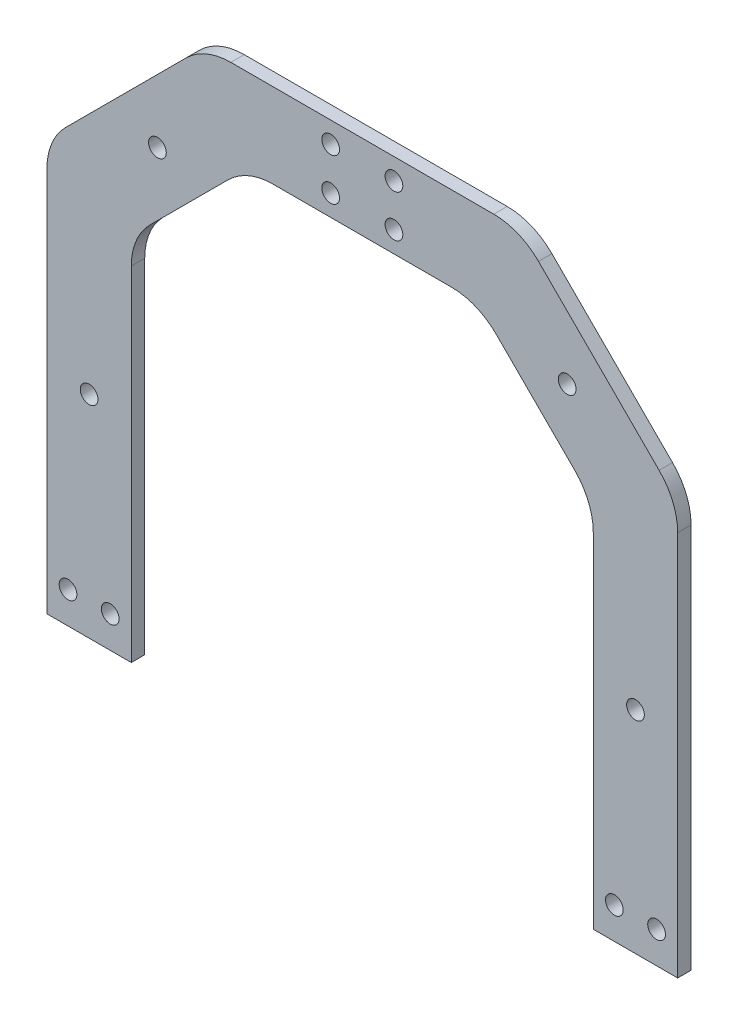
ISO-10303-21;
HEADER;
FILE_DESCRIPTION(('STEP AP214'),'2;1');
FILE_NAME('part.step','',(''),(''),'','','');
FILE_SCHEMA(('AUTOMOTIVE_DESIGN { 1 0 10303 214 1 1 1 1 }'));
ENDSEC;
DATA;
#1=APPLICATION_CONTEXT('core data for automotive mechanical design processes');
#2=APPLICATION_PROTOCOL_DEFINITION('international standard','automotive_design',2000,#1);
#3=PRODUCT_CONTEXT('',#1,'mechanical');
#4=PRODUCT('Part','Part','',(#3));
#5=PRODUCT_RELATED_PRODUCT_CATEGORY('part','',(#4));
#6=PRODUCT_DEFINITION_FORMATION('','',#4);
#7=PRODUCT_DEFINITION_CONTEXT('part definition',#1,'design');
#8=PRODUCT_DEFINITION('design','',#6,#7);
#9=PRODUCT_DEFINITION_SHAPE('','',#8);
#10=(LENGTH_UNIT() NAMED_UNIT(*) SI_UNIT(.MILLI.,.METRE.));
#11=(NAMED_UNIT(*) PLANE_ANGLE_UNIT() SI_UNIT($,.RADIAN.));
#12=(NAMED_UNIT(*) SI_UNIT($,.STERADIAN.) SOLID_ANGLE_UNIT());
#13=UNCERTAINTY_MEASURE_WITH_UNIT(LENGTH_MEASURE(1.E-05),#10,'distance_accuracy_value','');
#14=(GEOMETRIC_REPRESENTATION_CONTEXT(3) GLOBAL_UNCERTAINTY_ASSIGNED_CONTEXT((#13)) GLOBAL_UNIT_ASSIGNED_CONTEXT((#10,
#11,#12)) REPRESENTATION_CONTEXT('',''));
#15=CARTESIAN_POINT('',(0.,0.,0.));
#16=DIRECTION('',(0.,0.,1.));
#17=DIRECTION('',(1.,0.,0.));
#18=AXIS2_PLACEMENT_3D('',#15,#16,#17);
#19=CARTESIAN_POINT('',(109.5,0.,6.35));
#20=DIRECTION('',(0.,1.,0.));
#21=DIRECTION('',(-1.,0.,0.));
#22=AXIS2_PLACEMENT_3D('',#19,#20,#21);
#23=PLANE('',#22);
#24=DIRECTION('',(1.,0.,0.));
#25=VECTOR('',#24,1.);
#26=CARTESIAN_POINT('',(109.5,0.,0.));
#27=LINE('',#26,#25);
#28=CARTESIAN_POINT('',(109.5,0.,0.));
#29=VERTEX_POINT('',#28);
#30=CARTESIAN_POINT('',(149.5,0.,0.));
#31=VERTEX_POINT('',#30);
#32=EDGE_CURVE('E201',#29,#31,#27,.T.);
#33=ORIENTED_EDGE('',*,*,#32,.T.);
#34=DIRECTION('',(0.,0.,-1.));
#35=VECTOR('',#34,1.);
#36=CARTESIAN_POINT('',(149.5,0.,6.35));
#37=LINE('',#36,#35);
#38=CARTESIAN_POINT('',(149.5,0.,6.35));
#39=VERTEX_POINT('',#38);
#40=EDGE_CURVE('E11',#39,#31,#37,.T.);
#41=ORIENTED_EDGE('',*,*,#40,.F.);
#42=DIRECTION('',(1.,0.,0.));
#43=VECTOR('',#42,1.);
#44=CARTESIAN_POINT('',(109.5,0.,6.35));
#45=LINE('',#44,#43);
#46=CARTESIAN_POINT('',(109.5,0.,6.35));
#47=VERTEX_POINT('',#46);
#48=EDGE_CURVE('E240',#47,#39,#45,.T.);
#49=ORIENTED_EDGE('',*,*,#48,.F.);
#50=DIRECTION('',(0.,0.,-1.));
#51=VECTOR('',#50,1.);
#52=CARTESIAN_POINT('',(109.5,0.,6.35));
#53=LINE('',#52,#51);
#54=EDGE_CURVE('E197',#47,#29,#53,.T.);
#55=ORIENTED_EDGE('',*,*,#54,.T.);
#56=EDGE_LOOP('',(#33,#41,#49,#55));
#57=FACE_BOUND('',#56,.T.);
#58=ADVANCED_FACE('F33',(#57),#23,.F.);
#59=CARTESIAN_POINT('',(149.5,182.823593128805,6.35));
#60=DIRECTION('',(-1.,0.,0.));
#61=DIRECTION('',(0.,0.,1.));
#62=AXIS2_PLACEMENT_3D('',#59,#60,#61);
#63=PLANE('',#62);
#64=DIRECTION('',(0.,1.,0.));
#65=VECTOR('',#64,1.);
#66=CARTESIAN_POINT('',(149.5,182.823593128805,0.));
#67=LINE('',#66,#65);
#68=CARTESIAN_POINT('',(149.5,182.823593128805,0.));
#69=VERTEX_POINT('',#68);
#70=EDGE_CURVE('E204',#31,#69,#67,.T.);
#71=ORIENTED_EDGE('',*,*,#70,.T.);
#72=DIRECTION('',(0.,0.,-1.));
#73=VECTOR('',#72,1.);
#74=CARTESIAN_POINT('',(149.5,182.823593128805,6.35));
#75=LINE('',#74,#73);
#76=CARTESIAN_POINT('',(149.5,182.823593128805,6.35));
#77=VERTEX_POINT('',#76);
#78=EDGE_CURVE('E41',#77,#69,#75,.T.);
#79=ORIENTED_EDGE('',*,*,#78,.F.);
#80=DIRECTION('',(0.,1.,0.));
#81=VECTOR('',#80,1.);
#82=CARTESIAN_POINT('',(149.5,182.823593128805,6.35));
#83=LINE('',#82,#81);
#84=EDGE_CURVE('E128',#39,#77,#83,.T.);
#85=ORIENTED_EDGE('',*,*,#84,.F.);
#86=ORIENTED_EDGE('',*,*,#40,.T.);
#87=EDGE_LOOP('',(#71,#79,#85,#86));
#88=FACE_BOUND('',#87,.T.);
#89=ADVANCED_FACE('F359',(#88),#63,.F.);
#90=CARTESIAN_POINT('',(119.499999999992,182.823593128805,6.35));
#91=DIRECTION('',(0.,0.,-1.));
#92=DIRECTION('',(-1.,0.,0.));
#93=AXIS2_PLACEMENT_3D('',#90,#91,#92);
#94=CYLINDRICAL_SURFACE('',#93,30.0000000000081);
#95=CARTESIAN_POINT('',(119.499999999992,182.823593128805,0.));
#96=DIRECTION('',(0.,0.,1.));
#97=DIRECTION('',(1.,0.,0.));
#98=AXIS2_PLACEMENT_3D('',#95,#96,#97);
#99=CIRCLE('',#98,30.0000000000081);
#100=CARTESIAN_POINT('',(140.713203435594,204.036796564407,0.));
#101=VERTEX_POINT('',#100);
#102=EDGE_CURVE('E207',#69,#101,#99,.T.);
#103=ORIENTED_EDGE('',*,*,#102,.T.);
#104=DIRECTION('',(0.,0.,-1.));
#105=VECTOR('',#104,1.);
#106=CARTESIAN_POINT('',(140.713203435594,204.036796564407,6.35));
#107=LINE('',#106,#105);
#108=CARTESIAN_POINT('',(140.713203435594,204.036796564407,6.35));
#109=VERTEX_POINT('',#108);
#110=EDGE_CURVE('E283',#109,#101,#107,.T.);
#111=ORIENTED_EDGE('',*,*,#110,.F.);
#112=CARTESIAN_POINT('',(119.499999999992,182.823593128805,6.35));
#113=DIRECTION('',(0.,0.,1.));
#114=DIRECTION('',(1.,0.,0.));
#115=AXIS2_PLACEMENT_3D('',#112,#113,#114);
#116=CIRCLE('',#115,30.0000000000081);
#117=EDGE_CURVE('E291',#77,#109,#116,.T.);
#118=ORIENTED_EDGE('',*,*,#117,.F.);
#119=ORIENTED_EDGE('',*,*,#78,.T.);
#120=EDGE_LOOP('',(#103,#111,#118,#119));
#121=FACE_BOUND('',#120,.T.);
#122=ADVANCED_FACE('F289',(#121),#94,.T.);
#123=CARTESIAN_POINT('',(83.536796564406,261.213203435594,6.35));
#124=DIRECTION('',(-0.707106781186544,-0.707106781186551,0.));
#125=DIRECTION('',(0.707106781186551,-0.707106781186544,0.));
#126=AXIS2_PLACEMENT_3D('',#123,#124,#125);
#127=PLANE('',#126);
#128=DIRECTION('',(-0.707106781186551,0.707106781186544,0.));
#129=VECTOR('',#128,1.);
#130=CARTESIAN_POINT('',(83.536796564406,261.213203435594,0.));
#131=LINE('',#130,#129);
#132=CARTESIAN_POINT('',(83.536796564406,261.213203435594,0.));
#133=VERTEX_POINT('',#132);
#134=EDGE_CURVE('E209',#101,#133,#131,.T.);
#135=ORIENTED_EDGE('',*,*,#134,.T.);
#136=DIRECTION('',(0.,0.,-1.));
#137=VECTOR('',#136,1.);
#138=CARTESIAN_POINT('',(83.536796564406,261.213203435594,6.35));
#139=LINE('',#138,#137);
#140=CARTESIAN_POINT('',(83.536796564406,261.213203435594,6.35));
#141=VERTEX_POINT('',#140);
#142=EDGE_CURVE('E280',#141,#133,#139,.T.);
#143=ORIENTED_EDGE('',*,*,#142,.F.);
#144=DIRECTION('',(-0.707106781186551,0.707106781186544,0.));
#145=VECTOR('',#144,1.);
#146=CARTESIAN_POINT('',(83.536796564406,261.213203435594,6.35));
#147=LINE('',#146,#145);
#148=EDGE_CURVE('E309',#109,#141,#147,.T.);
#149=ORIENTED_EDGE('',*,*,#148,.F.);
#150=ORIENTED_EDGE('',*,*,#110,.T.);
#151=EDGE_LOOP('',(#135,#143,#149,#150));
#152=FACE_BOUND('',#151,.T.);
#153=ADVANCED_FACE('F300',(#152),#127,.F.);
#154=CARTESIAN_POINT('',(62.323593128804,239.999999999992,6.35));
#155=DIRECTION('',(0.,0.,-1.));
#156=DIRECTION('',(-1.,0.,0.));
#157=AXIS2_PLACEMENT_3D('',#154,#155,#156);
#158=CYLINDRICAL_SURFACE('',#157,30.0000000000081);
#159=CARTESIAN_POINT('',(62.323593128804,239.999999999992,0.));
#160=DIRECTION('',(0.,0.,1.));
#161=DIRECTION('',(1.,0.,0.));
#162=AXIS2_PLACEMENT_3D('',#159,#160,#161);
#163=CIRCLE('',#162,30.0000000000081);
#164=CARTESIAN_POINT('',(62.323593128804,270.,0.));
#165=VERTEX_POINT('',#164);
#166=EDGE_CURVE('E211',#133,#165,#163,.T.);
#167=ORIENTED_EDGE('',*,*,#166,.T.);
#168=DIRECTION('',(0.,0.,-1.));
#169=VECTOR('',#168,1.);
#170=CARTESIAN_POINT('',(62.323593128804,270.,6.35));
#171=LINE('',#170,#169);
#172=CARTESIAN_POINT('',(62.323593128804,270.,6.35));
#173=VERTEX_POINT('',#172);
#174=EDGE_CURVE('E277',#173,#165,#171,.T.);
#175=ORIENTED_EDGE('',*,*,#174,.F.);
#176=CARTESIAN_POINT('',(62.323593128804,239.999999999992,6.35));
#177=DIRECTION('',(0.,0.,1.));
#178=DIRECTION('',(1.,0.,0.));
#179=AXIS2_PLACEMENT_3D('',#176,#177,#178);
#180=CIRCLE('',#179,30.0000000000081);
#181=EDGE_CURVE('E306',#141,#173,#180,.T.);
#182=ORIENTED_EDGE('',*,*,#181,.F.);
#183=ORIENTED_EDGE('',*,*,#142,.T.);
#184=EDGE_LOOP('',(#167,#175,#182,#183));
#185=FACE_BOUND('',#184,.T.);
#186=ADVANCED_FACE('F304',(#185),#158,.T.);
#187=CARTESIAN_POINT('',(62.323593128804,270.,6.35));
#188=DIRECTION('',(0.,-1.,0.));
#189=DIRECTION('',(0.,0.,-1.));
#190=AXIS2_PLACEMENT_3D('',#187,#188,#189);
#191=PLANE('',#190);
#192=DIRECTION('',(-1.,0.,0.));
#193=VECTOR('',#192,1.);
#194=CARTESIAN_POINT('',(62.323593128804,270.,0.));
#195=LINE('',#194,#193);
#196=CARTESIAN_POINT('',(-62.323593128804,270.,0.));
#197=VERTEX_POINT('',#196);
#198=EDGE_CURVE('E213',#165,#197,#195,.T.);
#199=ORIENTED_EDGE('',*,*,#198,.T.);
#200=DIRECTION('',(0.,0.,-1.));
#201=VECTOR('',#200,1.);
#202=CARTESIAN_POINT('',(-62.323593128804,270.,6.35));
#203=LINE('',#202,#201);
#204=CARTESIAN_POINT('',(-62.323593128804,270.,6.35));
#205=VERTEX_POINT('',#204);
#206=EDGE_CURVE('E274',#205,#197,#203,.T.);
#207=ORIENTED_EDGE('',*,*,#206,.F.);
#208=DIRECTION('',(-1.,0.,0.));
#209=VECTOR('',#208,1.);
#210=CARTESIAN_POINT('',(62.323593128804,270.,6.35));
#211=LINE('',#210,#209);
#212=EDGE_CURVE('E308',#173,#205,#211,.T.);
#213=ORIENTED_EDGE('',*,*,#212,.F.);
#214=ORIENTED_EDGE('',*,*,#174,.T.);
#215=EDGE_LOOP('',(#199,#207,#213,#214));
#216=FACE_BOUND('',#215,.T.);
#217=ADVANCED_FACE('F372',(#216),#191,.F.);
#218=CARTESIAN_POINT('',(-62.323593128804,239.999999999992,6.35));
#219=DIRECTION('',(0.,0.,-1.));
#220=DIRECTION('',(-1.,0.,0.));
#221=AXIS2_PLACEMENT_3D('',#218,#219,#220);
#222=CYLINDRICAL_SURFACE('',#221,30.0000000000081);
#223=CARTESIAN_POINT('',(-62.323593128804,239.999999999992,0.));
#224=DIRECTION('',(0.,0.,1.));
#225=DIRECTION('',(-1.,0.,0.));
#226=AXIS2_PLACEMENT_3D('',#223,#224,#225);
#227=CIRCLE('',#226,30.0000000000081);
#228=CARTESIAN_POINT('',(-83.536796564406,261.213203435594,0.));
#229=VERTEX_POINT('',#228);
#230=EDGE_CURVE('E215',#197,#229,#227,.T.);
#231=ORIENTED_EDGE('',*,*,#230,.T.);
#232=DIRECTION('',(0.,0.,-1.));
#233=VECTOR('',#232,1.);
#234=CARTESIAN_POINT('',(-83.536796564406,261.213203435594,6.35));
#235=LINE('',#234,#233);
#236=CARTESIAN_POINT('',(-83.536796564406,261.213203435594,6.35));
#237=VERTEX_POINT('',#236);
#238=EDGE_CURVE('E271',#237,#229,#235,.T.);
#239=ORIENTED_EDGE('',*,*,#238,.F.);
#240=CARTESIAN_POINT('',(-62.323593128804,239.999999999992,6.35));
#241=DIRECTION('',(0.,0.,1.));
#242=DIRECTION('',(-1.,0.,0.));
#243=AXIS2_PLACEMENT_3D('',#240,#241,#242);
#244=CIRCLE('',#243,30.0000000000081);
#245=EDGE_CURVE('E311',#205,#237,#244,.T.);
#246=ORIENTED_EDGE('',*,*,#245,.F.);
#247=ORIENTED_EDGE('',*,*,#206,.T.);
#248=EDGE_LOOP('',(#231,#239,#246,#247));
#249=FACE_BOUND('',#248,.T.);
#250=ADVANCED_FACE('F375',(#249),#222,.T.);
#251=CARTESIAN_POINT('',(-83.536796564406,261.213203435594,6.35));
#252=DIRECTION('',(0.707106781186544,-0.707106781186551,0.));
#253=DIRECTION('',(0.707106781186551,0.707106781186544,0.));
#254=AXIS2_PLACEMENT_3D('',#251,#252,#253);
#255=PLANE('',#254);
#256=DIRECTION('',(-0.707106781186551,-0.707106781186544,0.));
#257=VECTOR('',#256,1.);
#258=CARTESIAN_POINT('',(-83.536796564406,261.213203435594,0.));
#259=LINE('',#258,#257);
#260=CARTESIAN_POINT('',(-140.713203435594,204.036796564407,0.));
#261=VERTEX_POINT('',#260);
#262=EDGE_CURVE('E217',#229,#261,#259,.T.);
#263=ORIENTED_EDGE('',*,*,#262,.T.);
#264=DIRECTION('',(0.,0.,-1.));
#265=VECTOR('',#264,1.);
#266=CARTESIAN_POINT('',(-140.713203435594,204.036796564407,6.35));
#267=LINE('',#266,#265);
#268=CARTESIAN_POINT('',(-140.713203435594,204.036796564407,6.35));
#269=VERTEX_POINT('',#268);
#270=EDGE_CURVE('E268',#269,#261,#267,.T.);
#271=ORIENTED_EDGE('',*,*,#270,.F.);
#272=DIRECTION('',(-0.707106781186551,-0.707106781186544,0.));
#273=VECTOR('',#272,1.);
#274=CARTESIAN_POINT('',(-83.536796564406,261.213203435594,6.35));
#275=LINE('',#274,#273);
#276=EDGE_CURVE('E317',#237,#269,#275,.T.);
#277=ORIENTED_EDGE('',*,*,#276,.F.);
#278=ORIENTED_EDGE('',*,*,#238,.T.);
#279=EDGE_LOOP('',(#263,#271,#277,#278));
#280=FACE_BOUND('',#279,.T.);
#281=ADVANCED_FACE('F379',(#280),#255,.F.);
#282=CARTESIAN_POINT('',(-119.499999999992,182.823593128805,6.35));
#283=DIRECTION('',(0.,0.,-1.));
#284=DIRECTION('',(-1.,0.,0.));
#285=AXIS2_PLACEMENT_3D('',#282,#283,#284);
#286=CYLINDRICAL_SURFACE('',#285,30.0000000000081);
#287=CARTESIAN_POINT('',(-119.499999999992,182.823593128805,0.));
#288=DIRECTION('',(0.,0.,1.));
#289=DIRECTION('',(1.,0.,0.));
#290=AXIS2_PLACEMENT_3D('',#287,#288,#289);
#291=CIRCLE('',#290,30.0000000000081);
#292=CARTESIAN_POINT('',(-149.5,182.823593128805,0.));
#293=VERTEX_POINT('',#292);
#294=EDGE_CURVE('E219',#261,#293,#291,.T.);
#295=ORIENTED_EDGE('',*,*,#294,.T.);
#296=DIRECTION('',(0.,0.,-1.));
#297=VECTOR('',#296,1.);
#298=CARTESIAN_POINT('',(-149.5,182.823593128805,6.35));
#299=LINE('',#298,#297);
#300=CARTESIAN_POINT('',(-149.5,182.823593128805,6.35));
#301=VERTEX_POINT('',#300);
#302=EDGE_CURVE('E265',#301,#293,#299,.T.);
#303=ORIENTED_EDGE('',*,*,#302,.F.);
#304=CARTESIAN_POINT('',(-119.499999999992,182.823593128805,6.35));
#305=DIRECTION('',(0.,0.,1.));
#306=DIRECTION('',(1.,0.,0.));
#307=AXIS2_PLACEMENT_3D('',#304,#305,#306);
#308=CIRCLE('',#307,30.0000000000081);
#309=EDGE_CURVE('E319',#269,#301,#308,.T.);
#310=ORIENTED_EDGE('',*,*,#309,.F.);
#311=ORIENTED_EDGE('',*,*,#270,.T.);
#312=EDGE_LOOP('',(#295,#303,#310,#311));
#313=FACE_BOUND('',#312,.T.);
#314=ADVANCED_FACE('F383',(#313),#286,.T.);
#315=CARTESIAN_POINT('',(-149.5,182.823593128805,6.35));
#316=DIRECTION('',(1.,0.,0.));
#317=DIRECTION('',(0.,0.,-1.));
#318=AXIS2_PLACEMENT_3D('',#315,#316,#317);
#319=PLANE('',#318);
#320=DIRECTION('',(0.,-1.,0.));
#321=VECTOR('',#320,1.);
#322=CARTESIAN_POINT('',(-149.5,182.823593128805,0.));
#323=LINE('',#322,#321);
#324=CARTESIAN_POINT('',(-149.5,0.,0.));
#325=VERTEX_POINT('',#324);
#326=EDGE_CURVE('E221',#293,#325,#323,.T.);
#327=ORIENTED_EDGE('',*,*,#326,.T.);
#328=DIRECTION('',(0.,0.,-1.));
#329=VECTOR('',#328,1.);
#330=CARTESIAN_POINT('',(-149.5,0.,6.35));
#331=LINE('',#330,#329);
#332=CARTESIAN_POINT('',(-149.5,0.,6.35));
#333=VERTEX_POINT('',#332);
#334=EDGE_CURVE('E262',#333,#325,#331,.T.);
#335=ORIENTED_EDGE('',*,*,#334,.F.);
#336=DIRECTION('',(0.,-1.,0.));
#337=VECTOR('',#336,1.);
#338=CARTESIAN_POINT('',(-149.5,182.823593128805,6.35));
#339=LINE('',#338,#337);
#340=EDGE_CURVE('E321',#301,#333,#339,.T.);
#341=ORIENTED_EDGE('',*,*,#340,.F.);
#342=ORIENTED_EDGE('',*,*,#302,.T.);
#343=EDGE_LOOP('',(#327,#335,#341,#342));
#344=FACE_BOUND('',#343,.T.);
#345=ADVANCED_FACE('F387',(#344),#319,.F.);
#346=CARTESIAN_POINT('',(-109.5,0.,6.35));
#347=DIRECTION('',(0.,1.,0.));
#348=DIRECTION('',(-1.,0.,0.));
#349=AXIS2_PLACEMENT_3D('',#346,#347,#348);
#350=PLANE('',#349);
#351=DIRECTION('',(1.,0.,0.));
#352=VECTOR('',#351,1.);
#353=CARTESIAN_POINT('',(-109.5,0.,0.));
#354=LINE('',#353,#352);
#355=CARTESIAN_POINT('',(-109.5,0.,0.));
#356=VERTEX_POINT('',#355);
#357=EDGE_CURVE('E223',#325,#356,#354,.T.);
#358=ORIENTED_EDGE('',*,*,#357,.T.);
#359=DIRECTION('',(0.,0.,-1.));
#360=VECTOR('',#359,1.);
#361=CARTESIAN_POINT('',(-109.5,0.,6.35));
#362=LINE('',#361,#360);
#363=CARTESIAN_POINT('',(-109.5,0.,6.35));
#364=VERTEX_POINT('',#363);
#365=EDGE_CURVE('E259',#364,#356,#362,.T.);
#366=ORIENTED_EDGE('',*,*,#365,.F.);
#367=DIRECTION('',(1.,0.,0.));
#368=VECTOR('',#367,1.);
#369=CARTESIAN_POINT('',(-109.5,0.,6.35));
#370=LINE('',#369,#368);
#371=EDGE_CURVE('E323',#333,#364,#370,.T.);
#372=ORIENTED_EDGE('',*,*,#371,.F.);
#373=ORIENTED_EDGE('',*,*,#334,.T.);
#374=EDGE_LOOP('',(#358,#366,#372,#373));
#375=FACE_BOUND('',#374,.T.);
#376=ADVANCED_FACE('F391',(#375),#350,.F.);
#377=CARTESIAN_POINT('',(-109.5,162.823593128805,6.35));
#378=DIRECTION('',(-1.,0.,0.));
#379=DIRECTION('',(0.,-1.,0.));
#380=AXIS2_PLACEMENT_3D('',#377,#378,#379);
#381=PLANE('',#380);
#382=DIRECTION('',(0.,1.,0.));
#383=VECTOR('',#382,1.);
#384=CARTESIAN_POINT('',(-109.5,162.823593128805,0.));
#385=LINE('',#384,#383);
#386=CARTESIAN_POINT('',(-109.5,162.823593128805,0.));
#387=VERTEX_POINT('',#386);
#388=EDGE_CURVE('E225',#356,#387,#385,.T.);
#389=ORIENTED_EDGE('',*,*,#388,.T.);
#390=DIRECTION('',(0.,0.,-1.));
#391=VECTOR('',#390,1.);
#392=CARTESIAN_POINT('',(-109.5,162.823593128805,6.35));
#393=LINE('',#392,#391);
#394=CARTESIAN_POINT('',(-109.5,162.823593128805,6.35));
#395=VERTEX_POINT('',#394);
#396=EDGE_CURVE('E256',#395,#387,#393,.T.);
#397=ORIENTED_EDGE('',*,*,#396,.F.);
#398=DIRECTION('',(0.,1.,0.));
#399=VECTOR('',#398,1.);
#400=CARTESIAN_POINT('',(-109.5,162.823593128805,6.35));
#401=LINE('',#400,#399);
#402=EDGE_CURVE('E325',#364,#395,#401,.T.);
#403=ORIENTED_EDGE('',*,*,#402,.F.);
#404=ORIENTED_EDGE('',*,*,#365,.T.);
#405=EDGE_LOOP('',(#389,#397,#403,#404));
#406=FACE_BOUND('',#405,.T.);
#407=ADVANCED_FACE('F395',(#406),#381,.F.);
#408=CARTESIAN_POINT('',(-79.4999999999919,162.823593128805,6.35));
#409=DIRECTION('',(0.,0.,-1.));
#410=DIRECTION('',(-1.,0.,0.));
#411=AXIS2_PLACEMENT_3D('',#408,#409,#410);
#412=CYLINDRICAL_SURFACE('',#411,30.0000000000081);
#413=CARTESIAN_POINT('',(-79.4999999999919,162.823593128805,0.));
#414=DIRECTION('',(0.,0.,-1.));
#415=DIRECTION('',(1.,0.,0.));
#416=AXIS2_PLACEMENT_3D('',#413,#414,#415);
#417=CIRCLE('',#416,30.0000000000081);
#418=CARTESIAN_POINT('',(-100.713203435594,184.036796564407,0.));
#419=VERTEX_POINT('',#418);
#420=EDGE_CURVE('E227',#387,#419,#417,.T.);
#421=ORIENTED_EDGE('',*,*,#420,.T.);
#422=DIRECTION('',(0.,0.,-1.));
#423=VECTOR('',#422,1.);
#424=CARTESIAN_POINT('',(-100.713203435594,184.036796564407,6.35));
#425=LINE('',#424,#423);
#426=CARTESIAN_POINT('',(-100.713203435594,184.036796564407,6.35));
#427=VERTEX_POINT('',#426);
#428=EDGE_CURVE('E253',#427,#419,#425,.T.);
#429=ORIENTED_EDGE('',*,*,#428,.F.);
#430=CARTESIAN_POINT('',(-79.4999999999919,162.823593128805,6.35));
#431=DIRECTION('',(0.,0.,-1.));
#432=DIRECTION('',(1.,0.,0.));
#433=AXIS2_PLACEMENT_3D('',#430,#431,#432);
#434=CIRCLE('',#433,30.0000000000081);
#435=EDGE_CURVE('E327',#395,#427,#434,.T.);
#436=ORIENTED_EDGE('',*,*,#435,.F.);
#437=ORIENTED_EDGE('',*,*,#396,.T.);
#438=EDGE_LOOP('',(#421,#429,#436,#437));
#439=FACE_BOUND('',#438,.T.);
#440=ADVANCED_FACE('F399',(#439),#412,.F.);
#441=CARTESIAN_POINT('',(-63.5367965644059,221.213203435594,6.35));
#442=DIRECTION('',(-0.707106781186539,0.707106781186556,0.));
#443=DIRECTION('',(-0.707106781186556,-0.707106781186539,0.));
#444=AXIS2_PLACEMENT_3D('',#441,#442,#443);
#445=PLANE('',#444);
#446=DIRECTION('',(0.707106781186556,0.707106781186539,0.));
#447=VECTOR('',#446,1.);
#448=CARTESIAN_POINT('',(-63.5367965644059,221.213203435594,0.));
#449=LINE('',#448,#447);
#450=CARTESIAN_POINT('',(-63.5367965644059,221.213203435594,0.));
#451=VERTEX_POINT('',#450);
#452=EDGE_CURVE('E229',#419,#451,#449,.T.);
#453=ORIENTED_EDGE('',*,*,#452,.T.);
#454=DIRECTION('',(0.,0.,-1.));
#455=VECTOR('',#454,1.);
#456=CARTESIAN_POINT('',(-63.5367965644059,221.213203435594,6.35));
#457=LINE('',#456,#455);
#458=CARTESIAN_POINT('',(-63.5367965644059,221.213203435594,6.35));
#459=VERTEX_POINT('',#458);
#460=EDGE_CURVE('E250',#459,#451,#457,.T.);
#461=ORIENTED_EDGE('',*,*,#460,.F.);
#462=DIRECTION('',(0.707106781186556,0.707106781186539,0.));
#463=VECTOR('',#462,1.);
#464=CARTESIAN_POINT('',(-63.5367965644059,221.213203435594,6.35));
#465=LINE('',#464,#463);
#466=EDGE_CURVE('E329',#427,#459,#465,.T.);
#467=ORIENTED_EDGE('',*,*,#466,.F.);
#468=ORIENTED_EDGE('',*,*,#428,.T.);
#469=EDGE_LOOP('',(#453,#461,#467,#468));
#470=FACE_BOUND('',#469,.T.);
#471=ADVANCED_FACE('F403',(#470),#445,.F.);
#472=CARTESIAN_POINT('',(-42.323593128804,199.999999999992,6.35));
#473=DIRECTION('',(0.,0.,-1.));
#474=DIRECTION('',(-1.,0.,0.));
#475=AXIS2_PLACEMENT_3D('',#472,#473,#474);
#476=CYLINDRICAL_SURFACE('',#475,30.0000000000081);
#477=CARTESIAN_POINT('',(-42.323593128804,199.999999999992,0.));
#478=DIRECTION('',(0.,0.,-1.));
#479=DIRECTION('',(-1.,0.,0.));
#480=AXIS2_PLACEMENT_3D('',#477,#478,#479);
#481=CIRCLE('',#480,30.0000000000081);
#482=CARTESIAN_POINT('',(-42.323593128804,230.,0.));
#483=VERTEX_POINT('',#482);
#484=EDGE_CURVE('E231',#451,#483,#481,.T.);
#485=ORIENTED_EDGE('',*,*,#484,.T.);
#486=DIRECTION('',(0.,0.,-1.));
#487=VECTOR('',#486,1.);
#488=CARTESIAN_POINT('',(-42.323593128804,230.,6.35));
#489=LINE('',#488,#487);
#490=CARTESIAN_POINT('',(-42.323593128804,230.,6.35));
#491=VERTEX_POINT('',#490);
#492=EDGE_CURVE('E247',#491,#483,#489,.T.);
#493=ORIENTED_EDGE('',*,*,#492,.F.);
#494=CARTESIAN_POINT('',(-42.323593128804,199.999999999992,6.35));
#495=DIRECTION('',(0.,0.,-1.));
#496=DIRECTION('',(-1.,0.,0.));
#497=AXIS2_PLACEMENT_3D('',#494,#495,#496);
#498=CIRCLE('',#497,30.0000000000081);
#499=EDGE_CURVE('E331',#459,#491,#498,.T.);
#500=ORIENTED_EDGE('',*,*,#499,.F.);
#501=ORIENTED_EDGE('',*,*,#460,.T.);
#502=EDGE_LOOP('',(#485,#493,#500,#501));
#503=FACE_BOUND('',#502,.T.);
#504=ADVANCED_FACE('F407',(#503),#476,.F.);
#505=CARTESIAN_POINT('',(42.323593128804,230.,6.35));
#506=DIRECTION('',(0.,1.,0.));
#507=DIRECTION('',(0.,0.,1.));
#508=AXIS2_PLACEMENT_3D('',#505,#506,#507);
#509=PLANE('',#508);
#510=DIRECTION('',(1.,0.,0.));
#511=VECTOR('',#510,1.);
#512=CARTESIAN_POINT('',(42.323593128804,230.,0.));
#513=LINE('',#512,#511);
#514=CARTESIAN_POINT('',(42.323593128804,230.,0.));
#515=VERTEX_POINT('',#514);
#516=EDGE_CURVE('E233',#483,#515,#513,.T.);
#517=ORIENTED_EDGE('',*,*,#516,.T.);
#518=DIRECTION('',(0.,0.,-1.));
#519=VECTOR('',#518,1.);
#520=CARTESIAN_POINT('',(42.323593128804,230.,6.35));
#521=LINE('',#520,#519);
#522=CARTESIAN_POINT('',(42.323593128804,230.,6.35));
#523=VERTEX_POINT('',#522);
#524=EDGE_CURVE('E244',#523,#515,#521,.T.);
#525=ORIENTED_EDGE('',*,*,#524,.F.);
#526=DIRECTION('',(1.,0.,0.));
#527=VECTOR('',#526,1.);
#528=CARTESIAN_POINT('',(42.323593128804,230.,6.35));
#529=LINE('',#528,#527);
#530=EDGE_CURVE('E333',#491,#523,#529,.T.);
#531=ORIENTED_EDGE('',*,*,#530,.F.);
#532=ORIENTED_EDGE('',*,*,#492,.T.);
#533=EDGE_LOOP('',(#517,#525,#531,#532));
#534=FACE_BOUND('',#533,.T.);
#535=ADVANCED_FACE('F339',(#534),#509,.F.);
#536=CARTESIAN_POINT('',(42.323593128804,199.999999999992,6.35));
#537=DIRECTION('',(0.,0.,-1.));
#538=DIRECTION('',(-1.,0.,0.));
#539=AXIS2_PLACEMENT_3D('',#536,#537,#538);
#540=CYLINDRICAL_SURFACE('',#539,30.0000000000081);
#541=CARTESIAN_POINT('',(42.323593128804,199.999999999992,0.));
#542=DIRECTION('',(0.,0.,-1.));
#543=DIRECTION('',(1.,0.,0.));
#544=AXIS2_PLACEMENT_3D('',#541,#542,#543);
#545=CIRCLE('',#544,30.0000000000081);
#546=CARTESIAN_POINT('',(63.5367965644058,221.213203435594,0.));
#547=VERTEX_POINT('',#546);
#548=EDGE_CURVE('E235',#515,#547,#545,.T.);
#549=ORIENTED_EDGE('',*,*,#548,.T.);
#550=DIRECTION('',(0.,0.,-1.));
#551=VECTOR('',#550,1.);
#552=CARTESIAN_POINT('',(63.5367965644058,221.213203435594,6.35));
#553=LINE('',#552,#551);
#554=CARTESIAN_POINT('',(63.5367965644058,221.213203435594,6.35));
#555=VERTEX_POINT('',#554);
#556=EDGE_CURVE('E192',#555,#547,#553,.T.);
#557=ORIENTED_EDGE('',*,*,#556,.F.);
#558=CARTESIAN_POINT('',(42.323593128804,199.999999999992,6.35));
#559=DIRECTION('',(0.,0.,-1.));
#560=DIRECTION('',(1.,0.,0.));
#561=AXIS2_PLACEMENT_3D('',#558,#559,#560);
#562=CIRCLE('',#561,30.0000000000081);
#563=EDGE_CURVE('E183',#523,#555,#562,.T.);
#564=ORIENTED_EDGE('',*,*,#563,.F.);
#565=ORIENTED_EDGE('',*,*,#524,.T.);
#566=EDGE_LOOP('',(#549,#557,#564,#565));
#567=FACE_BOUND('',#566,.T.);
#568=ADVANCED_FACE('F343',(#567),#540,.F.);
#569=CARTESIAN_POINT('',(63.5367965644059,221.213203435594,6.35));
#570=DIRECTION('',(0.707106781186539,0.707106781186556,0.));
#571=DIRECTION('',(-0.707106781186556,0.707106781186539,0.));
#572=AXIS2_PLACEMENT_3D('',#569,#570,#571);
#573=PLANE('',#572);
#574=DIRECTION('',(0.707106781186556,-0.707106781186539,0.));
#575=VECTOR('',#574,1.);
#576=CARTESIAN_POINT('',(63.5367965644059,221.213203435594,0.));
#577=LINE('',#576,#575);
#578=CARTESIAN_POINT('',(100.713203435594,184.036796564407,0.));
#579=VERTEX_POINT('',#578);
#580=EDGE_CURVE('E191',#547,#579,#577,.T.);
#581=ORIENTED_EDGE('',*,*,#580,.T.);
#582=DIRECTION('',(0.,0.,-1.));
#583=VECTOR('',#582,1.);
#584=CARTESIAN_POINT('',(100.713203435594,184.036796564407,6.35));
#585=LINE('',#584,#583);
#586=CARTESIAN_POINT('',(100.713203435594,184.036796564407,6.35));
#587=VERTEX_POINT('',#586);
#588=EDGE_CURVE('E188',#587,#579,#585,.T.);
#589=ORIENTED_EDGE('',*,*,#588,.F.);
#590=DIRECTION('',(0.707106781186556,-0.707106781186539,0.));
#591=VECTOR('',#590,1.);
#592=CARTESIAN_POINT('',(63.5367965644059,221.213203435594,6.35));
#593=LINE('',#592,#591);
#594=EDGE_CURVE('E177',#555,#587,#593,.T.);
#595=ORIENTED_EDGE('',*,*,#594,.F.);
#596=ORIENTED_EDGE('',*,*,#556,.T.);
#597=EDGE_LOOP('',(#581,#589,#595,#596));
#598=FACE_BOUND('',#597,.T.);
#599=ADVANCED_FACE('F189',(#598),#573,.F.);
#600=CARTESIAN_POINT('',(79.4999999999919,162.823593128805,6.35));
#601=DIRECTION('',(0.,0.,-1.));
#602=DIRECTION('',(-1.,0.,0.));
#603=AXIS2_PLACEMENT_3D('',#600,#601,#602);
#604=CYLINDRICAL_SURFACE('',#603,30.0000000000081);
#605=CARTESIAN_POINT('',(79.4999999999919,162.823593128805,0.));
#606=DIRECTION('',(0.,0.,-1.));
#607=DIRECTION('',(1.,0.,0.));
#608=AXIS2_PLACEMENT_3D('',#605,#606,#607);
#609=CIRCLE('',#608,30.0000000000081);
#610=CARTESIAN_POINT('',(109.5,162.823593128805,0.));
#611=VERTEX_POINT('',#610);
#612=EDGE_CURVE('E114',#579,#611,#609,.T.);
#613=ORIENTED_EDGE('',*,*,#612,.T.);
#614=DIRECTION('',(0.,0.,-1.));
#615=VECTOR('',#614,1.);
#616=CARTESIAN_POINT('',(109.5,162.823593128805,6.35));
#617=LINE('',#616,#615);
#618=CARTESIAN_POINT('',(109.5,162.823593128805,6.35));
#619=VERTEX_POINT('',#618);
#620=EDGE_CURVE('E193',#619,#611,#617,.T.);
#621=ORIENTED_EDGE('',*,*,#620,.F.);
#622=CARTESIAN_POINT('',(79.4999999999919,162.823593128805,6.35));
#623=DIRECTION('',(0.,0.,-1.));
#624=DIRECTION('',(1.,0.,0.));
#625=AXIS2_PLACEMENT_3D('',#622,#623,#624);
#626=CIRCLE('',#625,30.0000000000081);
#627=EDGE_CURVE('E181',#587,#619,#626,.T.);
#628=ORIENTED_EDGE('',*,*,#627,.F.);
#629=ORIENTED_EDGE('',*,*,#588,.T.);
#630=EDGE_LOOP('',(#613,#621,#628,#629));
#631=FACE_BOUND('',#630,.T.);
#632=ADVANCED_FACE('F195',(#631),#604,.F.);
#633=CARTESIAN_POINT('',(109.5,162.823593128805,6.35));
#634=DIRECTION('',(1.,0.,0.));
#635=DIRECTION('',(0.,1.,0.));
#636=AXIS2_PLACEMENT_3D('',#633,#634,#635);
#637=PLANE('',#636);
#638=DIRECTION('',(0.,-1.,0.));
#639=VECTOR('',#638,1.);
#640=CARTESIAN_POINT('',(109.5,162.823593128805,0.));
#641=LINE('',#640,#639);
#642=EDGE_CURVE('E120',#611,#29,#641,.T.);
#643=ORIENTED_EDGE('',*,*,#642,.T.);
#644=ORIENTED_EDGE('',*,*,#54,.F.);
#645=DIRECTION('',(0.,-1.,0.));
#646=VECTOR('',#645,1.);
#647=CARTESIAN_POINT('',(109.5,162.823593128805,6.35));
#648=LINE('',#647,#646);
#649=EDGE_CURVE('E49',#619,#47,#648,.T.);
#650=ORIENTED_EDGE('',*,*,#649,.F.);
#651=ORIENTED_EDGE('',*,*,#620,.T.);
#652=EDGE_LOOP('',(#643,#644,#650,#651));
#653=FACE_BOUND('',#652,.T.);
#654=ADVANCED_FACE('F347',(#653),#637,.F.);
#655=CARTESIAN_POINT('',(119.499999999992,182.823593128805,6.35));
#656=DIRECTION('',(0.,0.,1.));
#657=DIRECTION('',(1.,0.,0.));
#658=AXIS2_PLACEMENT_3D('',#655,#656,#657);
#659=PLANE('',#658);
#660=CARTESIAN_POINT('',(-119.5,15.,6.35));
#661=DIRECTION('',(0.,0.,1.));
#662=DIRECTION('',(1.,0.,0.));
#663=AXIS2_PLACEMENT_3D('',#660,#661,#662);
#664=CIRCLE('',#663,4.2);
#665=CARTESIAN_POINT('',(-115.3,15.,6.35));
#666=VERTEX_POINT('',#665);
#667=EDGE_CURVE('E573',#666,#666,#664,.T.);
#668=ORIENTED_EDGE('',*,*,#667,.F.);
#669=EDGE_LOOP('',(#668));
#670=FACE_BOUND('',#669,.T.);
#671=CARTESIAN_POINT('',(-139.5,15.,6.35));
#672=DIRECTION('',(0.,0.,1.));
#673=DIRECTION('',(1.,0.,0.));
#674=AXIS2_PLACEMENT_3D('',#671,#672,#673);
#675=CIRCLE('',#674,4.20000000000001);
#676=CARTESIAN_POINT('',(-135.3,15.,6.35));
#677=VERTEX_POINT('',#676);
#678=EDGE_CURVE('E575',#677,#677,#675,.T.);
#679=ORIENTED_EDGE('',*,*,#678,.F.);
#680=EDGE_LOOP('',(#679));
#681=FACE_BOUND('',#680,.T.);
#682=CARTESIAN_POINT('',(139.5,15.,6.35));
#683=DIRECTION('',(0.,0.,1.));
#684=DIRECTION('',(1.,0.,0.));
#685=AXIS2_PLACEMENT_3D('',#682,#683,#684);
#686=CIRCLE('',#685,4.20000000000001);
#687=CARTESIAN_POINT('',(143.7,15.,6.35));
#688=VERTEX_POINT('',#687);
#689=EDGE_CURVE('E583',#688,#688,#686,.T.);
#690=ORIENTED_EDGE('',*,*,#689,.F.);
#691=EDGE_LOOP('',(#690));
#692=FACE_BOUND('',#691,.T.);
#693=CARTESIAN_POINT('',(-15.,260.,6.35));
#694=DIRECTION('',(0.,0.,1.));
#695=DIRECTION('',(1.,0.,0.));
#696=AXIS2_PLACEMENT_3D('',#693,#694,#695);
#697=CIRCLE('',#696,4.2);
#698=CARTESIAN_POINT('',(-10.8,260.,6.35));
#699=VERTEX_POINT('',#698);
#700=EDGE_CURVE('E589',#699,#699,#697,.T.);
#701=ORIENTED_EDGE('',*,*,#700,.F.);
#702=EDGE_LOOP('',(#701));
#703=FACE_BOUND('',#702,.T.);
#704=CARTESIAN_POINT('',(-15.,240.,6.35));
#705=DIRECTION('',(0.,0.,1.));
#706=DIRECTION('',(1.,0.,0.));
#707=AXIS2_PLACEMENT_3D('',#704,#705,#706);
#708=CIRCLE('',#707,4.2);
#709=CARTESIAN_POINT('',(-10.8,240.,6.35));
#710=VERTEX_POINT('',#709);
#711=EDGE_CURVE('E595',#710,#710,#708,.T.);
#712=ORIENTED_EDGE('',*,*,#711,.F.);
#713=EDGE_LOOP('',(#712));
#714=FACE_BOUND('',#713,.T.);
#715=CARTESIAN_POINT('',(15.,240.,6.35));
#716=DIRECTION('',(0.,0.,1.));
#717=DIRECTION('',(1.,0.,0.));
#718=AXIS2_PLACEMENT_3D('',#715,#716,#717);
#719=CIRCLE('',#718,4.2);
#720=CARTESIAN_POINT('',(19.2,240.,6.35));
#721=VERTEX_POINT('',#720);
#722=EDGE_CURVE('E601',#721,#721,#719,.T.);
#723=ORIENTED_EDGE('',*,*,#722,.F.);
#724=EDGE_LOOP('',(#723));
#725=FACE_BOUND('',#724,.T.);
#726=CARTESIAN_POINT('',(15.,260.,6.35));
#727=DIRECTION('',(0.,0.,1.));
#728=DIRECTION('',(1.,0.,0.));
#729=AXIS2_PLACEMENT_3D('',#726,#727,#728);
#730=CIRCLE('',#729,4.2);
#731=CARTESIAN_POINT('',(19.2,260.,6.35));
#732=VERTEX_POINT('',#731);
#733=EDGE_CURVE('E607',#732,#732,#730,.T.);
#734=ORIENTED_EDGE('',*,*,#733,.F.);
#735=EDGE_LOOP('',(#734));
#736=FACE_BOUND('',#735,.T.);
#737=CARTESIAN_POINT('',(-129.5,100.125,6.35));
#738=DIRECTION('',(0.,0.,1.));
#739=DIRECTION('',(1.,0.,0.));
#740=AXIS2_PLACEMENT_3D('',#737,#738,#739);
#741=CIRCLE('',#740,4.20000000000001);
#742=CARTESIAN_POINT('',(-125.3,100.125,6.35));
#743=VERTEX_POINT('',#742);
#744=EDGE_CURVE('E613',#743,#743,#741,.T.);
#745=ORIENTED_EDGE('',*,*,#744,.F.);
#746=EDGE_LOOP('',(#745));
#747=FACE_BOUND('',#746,.T.);
#748=CARTESIAN_POINT('',(-97.1250000000003,217.625,6.35));
#749=DIRECTION('',(0.,0.,1.));
#750=DIRECTION('',(1.,0.,0.));
#751=AXIS2_PLACEMENT_3D('',#748,#749,#750);
#752=CIRCLE('',#751,4.2);
#753=CARTESIAN_POINT('',(-92.9250000000003,217.625,6.35));
#754=VERTEX_POINT('',#753);
#755=EDGE_CURVE('E619',#754,#754,#752,.T.);
#756=ORIENTED_EDGE('',*,*,#755,.F.);
#757=EDGE_LOOP('',(#756));
#758=FACE_BOUND('',#757,.T.);
#759=CARTESIAN_POINT('',(129.5,100.125,6.35));
#760=DIRECTION('',(0.,0.,1.));
#761=DIRECTION('',(1.,0.,0.));
#762=AXIS2_PLACEMENT_3D('',#759,#760,#761);
#763=CIRCLE('',#762,4.20000000000001);
#764=CARTESIAN_POINT('',(133.7,100.125,6.35));
#765=VERTEX_POINT('',#764);
#766=EDGE_CURVE('E625',#765,#765,#763,.T.);
#767=ORIENTED_EDGE('',*,*,#766,.F.);
#768=EDGE_LOOP('',(#767));
#769=FACE_BOUND('',#768,.T.);
#770=CARTESIAN_POINT('',(97.1250000000003,217.625,6.35));
#771=DIRECTION('',(0.,0.,1.));
#772=DIRECTION('',(1.,0.,0.));
#773=AXIS2_PLACEMENT_3D('',#770,#771,#772);
#774=CIRCLE('',#773,4.2);
#775=CARTESIAN_POINT('',(101.325,217.625,6.35));
#776=VERTEX_POINT('',#775);
#777=EDGE_CURVE('E631',#776,#776,#774,.T.);
#778=ORIENTED_EDGE('',*,*,#777,.F.);
#779=EDGE_LOOP('',(#778));
#780=FACE_BOUND('',#779,.T.);
#781=CARTESIAN_POINT('',(119.5,15.0000000000001,6.35));
#782=DIRECTION('',(0.,0.,1.));
#783=DIRECTION('',(1.,0.,0.));
#784=AXIS2_PLACEMENT_3D('',#781,#782,#783);
#785=CIRCLE('',#784,4.2);
#786=CARTESIAN_POINT('',(123.7,15.0000000000001,6.35));
#787=VERTEX_POINT('',#786);
#788=EDGE_CURVE('E637',#787,#787,#785,.T.);
#789=ORIENTED_EDGE('',*,*,#788,.F.);
#790=EDGE_LOOP('',(#789));
#791=FACE_BOUND('',#790,.T.);
#792=ORIENTED_EDGE('',*,*,#48,.T.);
#793=ORIENTED_EDGE('',*,*,#84,.T.);
#794=ORIENTED_EDGE('',*,*,#117,.T.);
#795=ORIENTED_EDGE('',*,*,#148,.T.);
#796=ORIENTED_EDGE('',*,*,#181,.T.);
#797=ORIENTED_EDGE('',*,*,#212,.T.);
#798=ORIENTED_EDGE('',*,*,#245,.T.);
#799=ORIENTED_EDGE('',*,*,#276,.T.);
#800=ORIENTED_EDGE('',*,*,#309,.T.);
#801=ORIENTED_EDGE('',*,*,#340,.T.);
#802=ORIENTED_EDGE('',*,*,#371,.T.);
#803=ORIENTED_EDGE('',*,*,#402,.T.);
#804=ORIENTED_EDGE('',*,*,#435,.T.);
#805=ORIENTED_EDGE('',*,*,#466,.T.);
#806=ORIENTED_EDGE('',*,*,#499,.T.);
#807=ORIENTED_EDGE('',*,*,#530,.T.);
#808=ORIENTED_EDGE('',*,*,#563,.T.);
#809=ORIENTED_EDGE('',*,*,#594,.T.);
#810=ORIENTED_EDGE('',*,*,#627,.T.);
#811=ORIENTED_EDGE('',*,*,#649,.T.);
#812=EDGE_LOOP('',(#792,#793,#794,#795,#796,#797,#798,#799,#800,#801,#802,#803,#804,#805,#806,
#807,#808,#809,#810,#811));
#813=FACE_BOUND('',#812,.T.);
#814=ADVANCED_FACE('F179',(#670,#681,#692,#703,#714,#725,#736,#747,#758,#769,#780,#791,#813),
#659,.T.);
#815=CARTESIAN_POINT('',(119.499999999992,182.823593128805,0.));
#816=DIRECTION('',(0.,0.,1.));
#817=DIRECTION('',(1.,0.,0.));
#818=AXIS2_PLACEMENT_3D('',#815,#816,#817);
#819=PLANE('',#818);
#820=CARTESIAN_POINT('',(-119.5,15.,0.));
#821=DIRECTION('',(0.,0.,1.));
#822=DIRECTION('',(1.,0.,0.));
#823=AXIS2_PLACEMENT_3D('',#820,#821,#822);
#824=CIRCLE('',#823,4.2);
#825=CARTESIAN_POINT('',(-115.3,15.,0.));
#826=VERTEX_POINT('',#825);
#827=EDGE_CURVE('E570',#826,#826,#824,.T.);
#828=ORIENTED_EDGE('',*,*,#827,.T.);
#829=EDGE_LOOP('',(#828));
#830=FACE_BOUND('',#829,.T.);
#831=CARTESIAN_POINT('',(-139.5,15.,0.));
#832=DIRECTION('',(0.,0.,1.));
#833=DIRECTION('',(1.,0.,0.));
#834=AXIS2_PLACEMENT_3D('',#831,#832,#833);
#835=CIRCLE('',#834,4.20000000000001);
#836=CARTESIAN_POINT('',(-135.3,15.,0.));
#837=VERTEX_POINT('',#836);
#838=EDGE_CURVE('E580',#837,#837,#835,.T.);
#839=ORIENTED_EDGE('',*,*,#838,.T.);
#840=EDGE_LOOP('',(#839));
#841=FACE_BOUND('',#840,.T.);
#842=CARTESIAN_POINT('',(139.5,15.,0.));
#843=DIRECTION('',(0.,0.,1.));
#844=DIRECTION('',(1.,0.,0.));
#845=AXIS2_PLACEMENT_3D('',#842,#843,#844);
#846=CIRCLE('',#845,4.20000000000001);
#847=CARTESIAN_POINT('',(143.7,15.,0.));
#848=VERTEX_POINT('',#847);
#849=EDGE_CURVE('E586',#848,#848,#846,.T.);
#850=ORIENTED_EDGE('',*,*,#849,.T.);
#851=EDGE_LOOP('',(#850));
#852=FACE_BOUND('',#851,.T.);
#853=CARTESIAN_POINT('',(-15.,260.,0.));
#854=DIRECTION('',(0.,0.,1.));
#855=DIRECTION('',(1.,0.,0.));
#856=AXIS2_PLACEMENT_3D('',#853,#854,#855);
#857=CIRCLE('',#856,4.2);
#858=CARTESIAN_POINT('',(-10.8,260.,0.));
#859=VERTEX_POINT('',#858);
#860=EDGE_CURVE('E592',#859,#859,#857,.T.);
#861=ORIENTED_EDGE('',*,*,#860,.T.);
#862=EDGE_LOOP('',(#861));
#863=FACE_BOUND('',#862,.T.);
#864=CARTESIAN_POINT('',(-15.,240.,0.));
#865=DIRECTION('',(0.,0.,1.));
#866=DIRECTION('',(1.,0.,0.));
#867=AXIS2_PLACEMENT_3D('',#864,#865,#866);
#868=CIRCLE('',#867,4.2);
#869=CARTESIAN_POINT('',(-10.8,240.,0.));
#870=VERTEX_POINT('',#869);
#871=EDGE_CURVE('E598',#870,#870,#868,.T.);
#872=ORIENTED_EDGE('',*,*,#871,.T.);
#873=EDGE_LOOP('',(#872));
#874=FACE_BOUND('',#873,.T.);
#875=CARTESIAN_POINT('',(15.,240.,0.));
#876=DIRECTION('',(0.,0.,1.));
#877=DIRECTION('',(1.,0.,0.));
#878=AXIS2_PLACEMENT_3D('',#875,#876,#877);
#879=CIRCLE('',#878,4.2);
#880=CARTESIAN_POINT('',(19.2,240.,0.));
#881=VERTEX_POINT('',#880);
#882=EDGE_CURVE('E604',#881,#881,#879,.T.);
#883=ORIENTED_EDGE('',*,*,#882,.T.);
#884=EDGE_LOOP('',(#883));
#885=FACE_BOUND('',#884,.T.);
#886=CARTESIAN_POINT('',(15.,260.,0.));
#887=DIRECTION('',(0.,0.,1.));
#888=DIRECTION('',(1.,0.,0.));
#889=AXIS2_PLACEMENT_3D('',#886,#887,#888);
#890=CIRCLE('',#889,4.2);
#891=CARTESIAN_POINT('',(19.2,260.,0.));
#892=VERTEX_POINT('',#891);
#893=EDGE_CURVE('E610',#892,#892,#890,.T.);
#894=ORIENTED_EDGE('',*,*,#893,.T.);
#895=EDGE_LOOP('',(#894));
#896=FACE_BOUND('',#895,.T.);
#897=CARTESIAN_POINT('',(-129.5,100.125,0.));
#898=DIRECTION('',(0.,0.,1.));
#899=DIRECTION('',(1.,0.,0.));
#900=AXIS2_PLACEMENT_3D('',#897,#898,#899);
#901=CIRCLE('',#900,4.20000000000001);
#902=CARTESIAN_POINT('',(-125.3,100.125,0.));
#903=VERTEX_POINT('',#902);
#904=EDGE_CURVE('E616',#903,#903,#901,.T.);
#905=ORIENTED_EDGE('',*,*,#904,.T.);
#906=EDGE_LOOP('',(#905));
#907=FACE_BOUND('',#906,.T.);
#908=CARTESIAN_POINT('',(-97.1250000000003,217.625,0.));
#909=DIRECTION('',(0.,0.,1.));
#910=DIRECTION('',(1.,0.,0.));
#911=AXIS2_PLACEMENT_3D('',#908,#909,#910);
#912=CIRCLE('',#911,4.2);
#913=CARTESIAN_POINT('',(-92.9250000000003,217.625,0.));
#914=VERTEX_POINT('',#913);
#915=EDGE_CURVE('E622',#914,#914,#912,.T.);
#916=ORIENTED_EDGE('',*,*,#915,.T.);
#917=EDGE_LOOP('',(#916));
#918=FACE_BOUND('',#917,.T.);
#919=CARTESIAN_POINT('',(129.5,100.125,0.));
#920=DIRECTION('',(0.,0.,1.));
#921=DIRECTION('',(1.,0.,0.));
#922=AXIS2_PLACEMENT_3D('',#919,#920,#921);
#923=CIRCLE('',#922,4.20000000000001);
#924=CARTESIAN_POINT('',(133.7,100.125,0.));
#925=VERTEX_POINT('',#924);
#926=EDGE_CURVE('E628',#925,#925,#923,.T.);
#927=ORIENTED_EDGE('',*,*,#926,.T.);
#928=EDGE_LOOP('',(#927));
#929=FACE_BOUND('',#928,.T.);
#930=CARTESIAN_POINT('',(97.1250000000003,217.625,0.));
#931=DIRECTION('',(0.,0.,1.));
#932=DIRECTION('',(1.,0.,0.));
#933=AXIS2_PLACEMENT_3D('',#930,#931,#932);
#934=CIRCLE('',#933,4.2);
#935=CARTESIAN_POINT('',(101.325,217.625,0.));
#936=VERTEX_POINT('',#935);
#937=EDGE_CURVE('E634',#936,#936,#934,.T.);
#938=ORIENTED_EDGE('',*,*,#937,.T.);
#939=EDGE_LOOP('',(#938));
#940=FACE_BOUND('',#939,.T.);
#941=CARTESIAN_POINT('',(119.5,15.0000000000001,0.));
#942=DIRECTION('',(0.,0.,1.));
#943=DIRECTION('',(1.,0.,0.));
#944=AXIS2_PLACEMENT_3D('',#941,#942,#943);
#945=CIRCLE('',#944,4.2);
#946=CARTESIAN_POINT('',(123.7,15.0000000000001,0.));
#947=VERTEX_POINT('',#946);
#948=EDGE_CURVE('E205',#947,#947,#945,.T.);
#949=ORIENTED_EDGE('',*,*,#948,.T.);
#950=EDGE_LOOP('',(#949));
#951=FACE_BOUND('',#950,.T.);
#952=ORIENTED_EDGE('',*,*,#32,.F.);
#953=ORIENTED_EDGE('',*,*,#642,.F.);
#954=ORIENTED_EDGE('',*,*,#612,.F.);
#955=ORIENTED_EDGE('',*,*,#580,.F.);
#956=ORIENTED_EDGE('',*,*,#548,.F.);
#957=ORIENTED_EDGE('',*,*,#516,.F.);
#958=ORIENTED_EDGE('',*,*,#484,.F.);
#959=ORIENTED_EDGE('',*,*,#452,.F.);
#960=ORIENTED_EDGE('',*,*,#420,.F.);
#961=ORIENTED_EDGE('',*,*,#388,.F.);
#962=ORIENTED_EDGE('',*,*,#357,.F.);
#963=ORIENTED_EDGE('',*,*,#326,.F.);
#964=ORIENTED_EDGE('',*,*,#294,.F.);
#965=ORIENTED_EDGE('',*,*,#262,.F.);
#966=ORIENTED_EDGE('',*,*,#230,.F.);
#967=ORIENTED_EDGE('',*,*,#198,.F.);
#968=ORIENTED_EDGE('',*,*,#166,.F.);
#969=ORIENTED_EDGE('',*,*,#134,.F.);
#970=ORIENTED_EDGE('',*,*,#102,.F.);
#971=ORIENTED_EDGE('',*,*,#70,.F.);
#972=EDGE_LOOP('',(#952,#953,#954,#955,#956,#957,#958,#959,#960,#961,#962,#963,#964,#965,#966,
#967,#968,#969,#970,#971));
#973=FACE_BOUND('',#972,.T.);
#974=ADVANCED_FACE('F295',(#830,#841,#852,#863,#874,#885,#896,#907,#918,#929,#940,#951,#973),
#819,.F.);
#975=CARTESIAN_POINT('',(119.5,15.0000000000001,6.35));
#976=DIRECTION('',(0.,0.,1.));
#977=DIRECTION('',(1.,0.,0.));
#978=AXIS2_PLACEMENT_3D('',#975,#976,#977);
#979=CYLINDRICAL_SURFACE('',#978,4.2);
#980=ORIENTED_EDGE('',*,*,#948,.F.);
#981=EDGE_LOOP('',(#980));
#982=FACE_BOUND('',#981,.T.);
#983=ORIENTED_EDGE('',*,*,#788,.T.);
#984=EDGE_LOOP('',(#983));
#985=FACE_BOUND('',#984,.T.);
#986=ADVANCED_FACE('F444',(#982,#985),#979,.F.);
#987=CARTESIAN_POINT('',(97.1250000000003,217.625,6.35));
#988=DIRECTION('',(0.,0.,1.));
#989=DIRECTION('',(1.,0.,0.));
#990=AXIS2_PLACEMENT_3D('',#987,#988,#989);
#991=CYLINDRICAL_SURFACE('',#990,4.2);
#992=ORIENTED_EDGE('',*,*,#937,.F.);
#993=EDGE_LOOP('',(#992));
#994=FACE_BOUND('',#993,.T.);
#995=ORIENTED_EDGE('',*,*,#777,.T.);
#996=EDGE_LOOP('',(#995));
#997=FACE_BOUND('',#996,.T.);
#998=ADVANCED_FACE('F453',(#994,#997),#991,.F.);
#999=CARTESIAN_POINT('',(129.5,100.125,6.35));
#1000=DIRECTION('',(0.,0.,1.));
#1001=DIRECTION('',(1.,0.,0.));
#1002=AXIS2_PLACEMENT_3D('',#999,#1000,#1001);
#1003=CYLINDRICAL_SURFACE('',#1002,4.20000000000001);
#1004=ORIENTED_EDGE('',*,*,#926,.F.);
#1005=EDGE_LOOP('',(#1004));
#1006=FACE_BOUND('',#1005,.T.);
#1007=ORIENTED_EDGE('',*,*,#766,.T.);
#1008=EDGE_LOOP('',(#1007));
#1009=FACE_BOUND('',#1008,.T.);
#1010=ADVANCED_FACE('F463',(#1006,#1009),#1003,.F.);
#1011=CARTESIAN_POINT('',(-97.1250000000003,217.625,6.35));
#1012=DIRECTION('',(0.,0.,1.));
#1013=DIRECTION('',(1.,0.,0.));
#1014=AXIS2_PLACEMENT_3D('',#1011,#1012,#1013);
#1015=CYLINDRICAL_SURFACE('',#1014,4.2);
#1016=ORIENTED_EDGE('',*,*,#915,.F.);
#1017=EDGE_LOOP('',(#1016));
#1018=FACE_BOUND('',#1017,.T.);
#1019=ORIENTED_EDGE('',*,*,#755,.T.);
#1020=EDGE_LOOP('',(#1019));
#1021=FACE_BOUND('',#1020,.T.);
#1022=ADVANCED_FACE('F473',(#1018,#1021),#1015,.F.);
#1023=CARTESIAN_POINT('',(-129.5,100.125,6.35));
#1024=DIRECTION('',(0.,0.,1.));
#1025=DIRECTION('',(1.,0.,0.));
#1026=AXIS2_PLACEMENT_3D('',#1023,#1024,#1025);
#1027=CYLINDRICAL_SURFACE('',#1026,4.20000000000001);
#1028=ORIENTED_EDGE('',*,*,#904,.F.);
#1029=EDGE_LOOP('',(#1028));
#1030=FACE_BOUND('',#1029,.T.);
#1031=ORIENTED_EDGE('',*,*,#744,.T.);
#1032=EDGE_LOOP('',(#1031));
#1033=FACE_BOUND('',#1032,.T.);
#1034=ADVANCED_FACE('F483',(#1030,#1033),#1027,.F.);
#1035=CARTESIAN_POINT('',(15.,260.,6.35));
#1036=DIRECTION('',(0.,0.,1.));
#1037=DIRECTION('',(1.,0.,0.));
#1038=AXIS2_PLACEMENT_3D('',#1035,#1036,#1037);
#1039=CYLINDRICAL_SURFACE('',#1038,4.2);
#1040=ORIENTED_EDGE('',*,*,#893,.F.);
#1041=EDGE_LOOP('',(#1040));
#1042=FACE_BOUND('',#1041,.T.);
#1043=ORIENTED_EDGE('',*,*,#733,.T.);
#1044=EDGE_LOOP('',(#1043));
#1045=FACE_BOUND('',#1044,.T.);
#1046=ADVANCED_FACE('F493',(#1042,#1045),#1039,.F.);
#1047=CARTESIAN_POINT('',(15.,240.,6.35));
#1048=DIRECTION('',(0.,0.,1.));
#1049=DIRECTION('',(1.,0.,0.));
#1050=AXIS2_PLACEMENT_3D('',#1047,#1048,#1049);
#1051=CYLINDRICAL_SURFACE('',#1050,4.2);
#1052=ORIENTED_EDGE('',*,*,#882,.F.);
#1053=EDGE_LOOP('',(#1052));
#1054=FACE_BOUND('',#1053,.T.);
#1055=ORIENTED_EDGE('',*,*,#722,.T.);
#1056=EDGE_LOOP('',(#1055));
#1057=FACE_BOUND('',#1056,.T.);
#1058=ADVANCED_FACE('F503',(#1054,#1057),#1051,.F.);
#1059=CARTESIAN_POINT('',(-15.,240.,6.35));
#1060=DIRECTION('',(0.,0.,1.));
#1061=DIRECTION('',(1.,0.,0.));
#1062=AXIS2_PLACEMENT_3D('',#1059,#1060,#1061);
#1063=CYLINDRICAL_SURFACE('',#1062,4.2);
#1064=ORIENTED_EDGE('',*,*,#871,.F.);
#1065=EDGE_LOOP('',(#1064));
#1066=FACE_BOUND('',#1065,.T.);
#1067=ORIENTED_EDGE('',*,*,#711,.T.);
#1068=EDGE_LOOP('',(#1067));
#1069=FACE_BOUND('',#1068,.T.);
#1070=ADVANCED_FACE('F513',(#1066,#1069),#1063,.F.);
#1071=CARTESIAN_POINT('',(-15.,260.,6.35));
#1072=DIRECTION('',(0.,0.,1.));
#1073=DIRECTION('',(1.,0.,0.));
#1074=AXIS2_PLACEMENT_3D('',#1071,#1072,#1073);
#1075=CYLINDRICAL_SURFACE('',#1074,4.2);
#1076=ORIENTED_EDGE('',*,*,#860,.F.);
#1077=EDGE_LOOP('',(#1076));
#1078=FACE_BOUND('',#1077,.T.);
#1079=ORIENTED_EDGE('',*,*,#700,.T.);
#1080=EDGE_LOOP('',(#1079));
#1081=FACE_BOUND('',#1080,.T.);
#1082=ADVANCED_FACE('F523',(#1078,#1081),#1075,.F.);
#1083=CARTESIAN_POINT('',(139.5,15.,6.35));
#1084=DIRECTION('',(0.,0.,1.));
#1085=DIRECTION('',(1.,0.,0.));
#1086=AXIS2_PLACEMENT_3D('',#1083,#1084,#1085);
#1087=CYLINDRICAL_SURFACE('',#1086,4.20000000000001);
#1088=ORIENTED_EDGE('',*,*,#849,.F.);
#1089=EDGE_LOOP('',(#1088));
#1090=FACE_BOUND('',#1089,.T.);
#1091=ORIENTED_EDGE('',*,*,#689,.T.);
#1092=EDGE_LOOP('',(#1091));
#1093=FACE_BOUND('',#1092,.T.);
#1094=ADVANCED_FACE('F533',(#1090,#1093),#1087,.F.);
#1095=CARTESIAN_POINT('',(-139.5,15.,6.35));
#1096=DIRECTION('',(0.,0.,1.));
#1097=DIRECTION('',(1.,0.,0.));
#1098=AXIS2_PLACEMENT_3D('',#1095,#1096,#1097);
#1099=CYLINDRICAL_SURFACE('',#1098,4.20000000000001);
#1100=ORIENTED_EDGE('',*,*,#838,.F.);
#1101=EDGE_LOOP('',(#1100));
#1102=FACE_BOUND('',#1101,.T.);
#1103=ORIENTED_EDGE('',*,*,#678,.T.);
#1104=EDGE_LOOP('',(#1103));
#1105=FACE_BOUND('',#1104,.T.);
#1106=ADVANCED_FACE('F543',(#1102,#1105),#1099,.F.);
#1107=CARTESIAN_POINT('',(-119.5,15.,6.35));
#1108=DIRECTION('',(0.,0.,1.));
#1109=DIRECTION('',(1.,0.,0.));
#1110=AXIS2_PLACEMENT_3D('',#1107,#1108,#1109);
#1111=CYLINDRICAL_SURFACE('',#1110,4.2);
#1112=ORIENTED_EDGE('',*,*,#827,.F.);
#1113=EDGE_LOOP('',(#1112));
#1114=FACE_BOUND('',#1113,.T.);
#1115=ORIENTED_EDGE('',*,*,#667,.T.);
#1116=EDGE_LOOP('',(#1115));
#1117=FACE_BOUND('',#1116,.T.);
#1118=ADVANCED_FACE('F553',(#1114,#1117),#1111,.F.);
#1119=CLOSED_SHELL('',(#58,#89,#122,#153,#186,#217,#250,#281,#314,#345,#376,#407,#440,#471,#504,
#535,#568,#599,#632,#654,#814,#974,#986,#998,#1010,#1022,#1034,#1046,#1058,#1070,#1082,#1094,
#1106,#1118));
#1120=MANIFOLD_SOLID_BREP('B2',#1119);
#1121=ADVANCED_BREP_SHAPE_REPRESENTATION('',(#18,#1120),#14);
#1122=SHAPE_DEFINITION_REPRESENTATION(#9,#1121);
ENDSEC;
END-ISO-10303-21;
